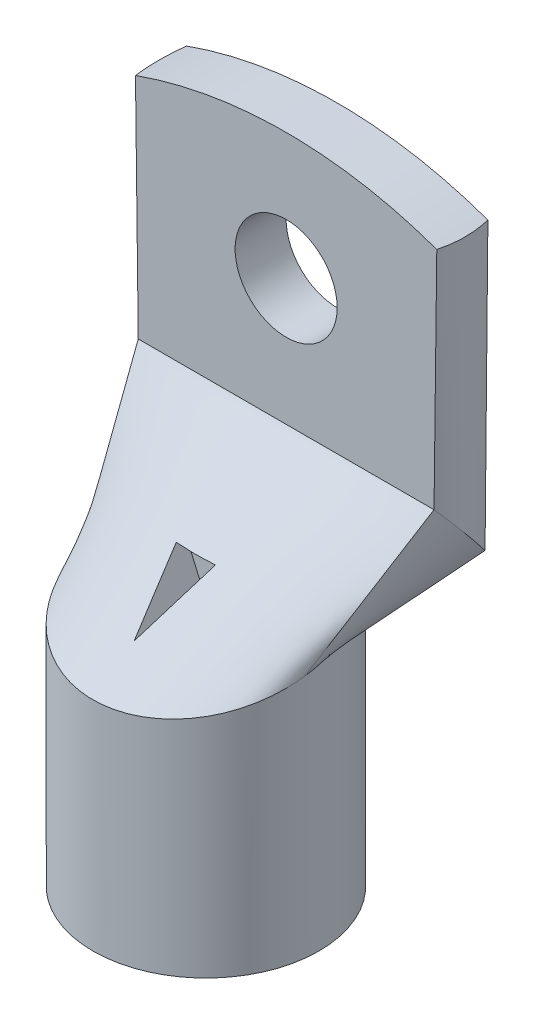
ISO-10303-21;
HEADER;
FILE_DESCRIPTION(('STEP AP214'),'2;1');
FILE_NAME('part.step','',(''),(''),'','','');
FILE_SCHEMA(('AUTOMOTIVE_DESIGN { 1 0 10303 214 1 1 1 1 }'));
ENDSEC;
DATA;
#1=APPLICATION_CONTEXT('core data for automotive mechanical design processes');
#2=APPLICATION_PROTOCOL_DEFINITION('international standard','automotive_design',2000,#1);
#3=PRODUCT_CONTEXT('',#1,'mechanical');
#4=PRODUCT('Part','Part','',(#3));
#5=PRODUCT_RELATED_PRODUCT_CATEGORY('part','',(#4));
#6=PRODUCT_DEFINITION_FORMATION('','',#4);
#7=PRODUCT_DEFINITION_CONTEXT('part definition',#1,'design');
#8=PRODUCT_DEFINITION('design','',#6,#7);
#9=PRODUCT_DEFINITION_SHAPE('','',#8);
#10=(LENGTH_UNIT() NAMED_UNIT(*) SI_UNIT(.MILLI.,.METRE.));
#11=(NAMED_UNIT(*) PLANE_ANGLE_UNIT() SI_UNIT($,.RADIAN.));
#12=(NAMED_UNIT(*) SI_UNIT($,.STERADIAN.) SOLID_ANGLE_UNIT());
#13=UNCERTAINTY_MEASURE_WITH_UNIT(LENGTH_MEASURE(1.E-05),#10,'distance_accuracy_value','');
#14=(GEOMETRIC_REPRESENTATION_CONTEXT(3) GLOBAL_UNCERTAINTY_ASSIGNED_CONTEXT((#13)) GLOBAL_UNIT_ASSIGNED_CONTEXT((#10,
#11,#12)) REPRESENTATION_CONTEXT('',''));
#15=CARTESIAN_POINT('',(0.,0.,0.));
#16=DIRECTION('',(0.,0.,1.));
#17=DIRECTION('',(1.,0.,0.));
#18=AXIS2_PLACEMENT_3D('',#15,#16,#17);
#19=CARTESIAN_POINT('',(-7.69708209556776,16.7577426297167,0.90411681440524));
#20=CARTESIAN_POINT('',(-10.140902466473,24.6565201889272,-5.50000000000008));
#21=CARTESIAN_POINT('',(-6.2409424750663,13.4360683486743,13.3007739974504));
#22=CARTESIAN_POINT('',(-3.38030082215754,24.6565201889272,-5.50000000000002));
#23=CARTESIAN_POINT('',(6.24094247506601,13.4360683486743,13.3007739974505));
#24=CARTESIAN_POINT('',(3.38030082215793,24.6565201889272,-5.49999999999996));
#25=CARTESIAN_POINT('',(7.69708209556774,16.7577426297167,0.904116814405403));
#26=CARTESIAN_POINT('',(10.1409024664734,24.6565201889271,-5.4999999999999));
#27=(BOUNDED_SURFACE() B_SPLINE_SURFACE(3,1,((#19,#20),(#21,#22),(#23,#24),(#25,#26)),
.UNSPECIFIED.,.F.,.F.,.F.) B_SPLINE_SURFACE_WITH_KNOTS((4,4),(2,2),(0.,1.),(0.,1.),
.UNSPECIFIED.) GEOMETRIC_REPRESENTATION_ITEM() RATIONAL_B_SPLINE_SURFACE(((1.,1.),
(0.411106822744544,1.),(0.411106822744544,1.),(1.,1.))) REPRESENTATION_ITEM('') SURFACE());
#28=CARTESIAN_POINT('',(0.,17.,0.));
#29=DIRECTION('',(0.,0.965925826289068,0.258819045102521));
#30=DIRECTION('',(0.,-0.258819045102521,0.965925826289068));
#31=AXIS2_PLACEMENT_3D('',#28,#29,#30);
#32=ELLIPSE('',#31,8.02339039817815,7.75);
#33=CARTESIAN_POINT('',(-7.69708209556776,16.7577426297167,0.904116814405239));
#34=VERTEX_POINT('',#33);
#35=CARTESIAN_POINT('',(7.69708209556774,16.7577426297167,0.904116814405399));
#36=VERTEX_POINT('',#35);
#37=EDGE_CURVE('E377',#34,#36,#32,.T.);
#38=DIRECTION('',(0.233673219935645,0.755265324649086,-0.612348851283007));
#39=VECTOR('',#38,1.);
#40=CARTESIAN_POINT('',(8.91899228102057,20.7071314093219,-2.29794159279725));
#41=LINE('',#40,#39);
#42=CARTESIAN_POINT('',(10.1409024664734,24.6565201889271,-5.4999999999999));
#43=VERTEX_POINT('',#42);
#44=EDGE_CURVE('E393',#36,#43,#41,.T.);
#45=DIRECTION('',(1.,0.,0.));
#46=VECTOR('',#45,1.);
#47=CARTESIAN_POINT('',(10.1409024664734,24.6565201889271,-5.4999999999999));
#48=LINE('',#47,#46);
#49=CARTESIAN_POINT('',(-10.140902466473,24.6565201889272,-5.50000000000008));
#50=VERTEX_POINT('',#49);
#51=EDGE_CURVE('E401',#50,#43,#48,.T.);
#52=DIRECTION('',(0.233673219935606,-0.755265324649097,0.612348851283008));
#53=VECTOR('',#52,1.);
#54=CARTESIAN_POINT('',(-8.91899228102038,20.707131409322,-2.29794159279742));
#55=LINE('',#54,#53);
#56=EDGE_CURVE('E369',#50,#34,#55,.T.);
#57=CARTESIAN_POINT('',(0.,17.,4.92305298611925));
#58=CARTESIAN_POINT('',(-0.0751985066648847,17.1719744440827,4.68894175336969));
#59=CARTESIAN_POINT('',(-0.150275794704584,17.3436716684891,4.45458828098868));
#60=CARTESIAN_POINT('',(-0.300220382164358,17.6865858860084,3.98546516180018));
#61=CARTESIAN_POINT('',(-0.375087682691752,17.8578028816536,3.75069551719797));
#62=CARTESIAN_POINT('',(-0.524645455877794,18.1998324782856,3.28080614016192));
#63=CARTESIAN_POINT('',(-0.5993359287297,18.3706450797143,3.04568640811115));
#64=CARTESIAN_POINT('',(-0.748577989025629,18.7119526600301,2.57517317960015));
#65=CARTESIAN_POINT('',(-0.823129576695926,18.8824476394347,2.33977968358695));
#66=CARTESIAN_POINT('',(-0.972136503512343,19.2232174836807,1.86880201562798));
#67=CARTESIAN_POINT('',(-1.04659184239497,19.3934923479196,1.63321784316306));
#68=CARTESIAN_POINT('',(-1.19545680541074,19.7339375295256,1.16195826595706));
#69=CARTESIAN_POINT('',(-1.2698664293937,19.9041078465493,0.926282860920371));
#70=CARTESIAN_POINT('',(-1.34427832178265,20.0742833512806,0.690612010626282));
#71=B_SPLINE_CURVE_WITH_KNOTS('',3,(#57,#58,#59,#60,#61,#62,#63,#64,#65,#66,#67,#68,#69,#70),
.UNSPECIFIED.,.F.,.F.,(4,2,2,2,2,2,4),(0.,0.900189821345339,1.80037488679664,2.70055896796332,
3.60074158124932,4.50092665373602,5.40111466790692),.UNSPECIFIED.);
#72=CARTESIAN_POINT('',(0.,17.,4.92305298611925));
#73=VERTEX_POINT('',#72);
#74=CARTESIAN_POINT('',(-1.34427832178265,20.0742833512806,0.69061201062626));
#75=VERTEX_POINT('',#74);
#76=EDGE_CURVE('E51',#73,#75,#71,.T.);
#77=CARTESIAN_POINT('',(-1.34427832178265,20.0742833512806,0.690612010626253));
#78=CARTESIAN_POINT('',(-1.23232010981124,20.0742833512806,0.698526686812677));
#79=CARTESIAN_POINT('',(-1.12029152604522,20.0742833512806,0.705442561506306));
#80=CARTESIAN_POINT('',(-0.896233587420302,20.0742833512806,0.717280956945361));
#81=CARTESIAN_POINT('',(-0.784204330275656,20.0742833512806,0.722205326509219));
#82=CARTESIAN_POINT('',(-0.560145759605504,20.0742833512806,0.73007721963578));
#83=CARTESIAN_POINT('',(-0.448116488867758,20.0742833512806,0.733025962528388));
#84=CARTESIAN_POINT('',(-0.22405813830731,20.0742833512806,0.73695599093034));
#85=CARTESIAN_POINT('',(-0.112029069153656,20.0742833512806,0.737937884994995));
#86=CARTESIAN_POINT('',(0.112029069153653,20.0742833512806,0.737937884994999));
#87=CARTESIAN_POINT('',(0.224058138307308,20.0742833512806,0.736955990930349));
#88=CARTESIAN_POINT('',(0.448116488867755,20.0742833512806,0.7330259625284));
#89=CARTESIAN_POINT('',(0.560145759605501,20.0742833512806,0.730077219635791));
#90=CARTESIAN_POINT('',(0.784204330275653,20.0742833512806,0.722205326509231));
#91=CARTESIAN_POINT('',(0.8962335874203,20.0742833512806,0.717280956945376));
#92=CARTESIAN_POINT('',(1.12029152604521,20.0742833512806,0.705442561506326));
#93=CARTESIAN_POINT('',(1.23232010981124,20.0742833512806,0.6985266868127));
#94=CARTESIAN_POINT('',(1.34427832178265,20.0742833512806,0.69061201062628));
#95=B_SPLINE_CURVE_WITH_KNOTS('',3,(#77,#78,#79,#80,#81,#82,#83,#84,#85,#86,#87,#88,#89,#90,#91,
#92,#93,#94),.UNSPECIFIED.,.F.,.F.,(4,2,2,2,2,2,2,2,4),(0.,0.336708044001101,0.673102782772896,
1.00928971156104,1.34537260593714,1.68145550031325,2.01764242910139,2.35403716787318,
2.69074521187428),.UNSPECIFIED.);
#96=CARTESIAN_POINT('',(1.34427832178265,20.0742833512806,0.690612010626283));
#97=VERTEX_POINT('',#96);
#98=EDGE_CURVE('E11',#75,#97,#95,.T.);
#99=CARTESIAN_POINT('',(1.34427832178265,20.0742833512806,0.690612010626276));
#100=CARTESIAN_POINT('',(1.2698664293937,19.9041078465494,0.926282860920369));
#101=CARTESIAN_POINT('',(1.19545680541075,19.7339375295257,1.16195826595706));
#102=CARTESIAN_POINT('',(1.04659184239498,19.3934923479196,1.63321784316306));
#103=CARTESIAN_POINT('',(0.972136503512349,19.2232174836807,1.86880201562798));
#104=CARTESIAN_POINT('',(0.823129576695929,18.8824476394347,2.33977968358696));
#105=CARTESIAN_POINT('',(0.748577989025632,18.7119526600301,2.57517317960016));
#106=CARTESIAN_POINT('',(0.599335928729702,18.3706450797143,3.04568640811116));
#107=CARTESIAN_POINT('',(0.524645455877795,18.1998324782856,3.28080614016193));
#108=CARTESIAN_POINT('',(0.37508768269175,17.8578028816536,3.75069551719798));
#109=CARTESIAN_POINT('',(0.300220382164353,17.6865858860084,3.98546516180019));
#110=CARTESIAN_POINT('',(0.150275794704576,17.3436716684891,4.45458828098869));
#111=CARTESIAN_POINT('',(0.075198506664877,17.1719744440827,4.6889417533697));
#112=CARTESIAN_POINT('',(0.,17.,4.92305298611927));
#113=B_SPLINE_CURVE_WITH_KNOTS('',3,(#99,#100,#101,#102,#103,#104,#105,#106,#107,#108,#109,#110,
#111,#112),.UNSPECIFIED.,.F.,.F.,(4,2,2,2,2,2,4),(0.,0.900188014170906,1.80037308665761,
2.70055569994362,3.60073978111031,4.50092484656161,5.40111466790696),.UNSPECIFIED.);
#114=EDGE_CURVE('E211',#97,#73,#113,.T.);
#115=ORIENTED_EDGE('',*,*,#37,.T.);
#116=ORIENTED_EDGE('',*,*,#44,.T.);
#117=ORIENTED_EDGE('',*,*,#51,.F.);
#118=ORIENTED_EDGE('',*,*,#56,.T.);
#119=EDGE_LOOP('',(#115,#116,#117,#118));
#120=FACE_BOUND('',#119,.T.);
#121=ORIENTED_EDGE('',*,*,#76,.T.);
#122=ORIENTED_EDGE('',*,*,#98,.T.);
#123=ORIENTED_EDGE('',*,*,#114,.T.);
#124=EDGE_LOOP('',(#121,#122,#123));
#125=FACE_BOUND('',#124,.T.);
#126=ADVANCED_FACE('F38',(#120,#125),#27,.T.);
#127=CARTESIAN_POINT('',(0.,39.3069426257091,0.));
#128=DIRECTION('',(0.,-1.,0.));
#129=DIRECTION('',(0.,0.,-1.));
#130=AXIS2_PLACEMENT_3D('',#127,#128,#129);
#131=CYLINDRICAL_SURFACE('',#130,7.75);
#132=CARTESIAN_POINT('',(0.,0.,0.));
#133=DIRECTION('',(0.,1.,0.));
#134=DIRECTION('',(0.,0.,1.));
#135=AXIS2_PLACEMENT_3D('',#132,#133,#134);
#136=CIRCLE('',#135,7.75);
#137=CARTESIAN_POINT('',(0.,0.,7.75));
#138=VERTEX_POINT('',#137);
#139=EDGE_CURVE('E354',#138,#138,#136,.T.);
#140=ORIENTED_EDGE('',*,*,#139,.T.);
#141=EDGE_LOOP('',(#140));
#142=FACE_BOUND('',#141,.T.);
#143=CARTESIAN_POINT('',(0.,17.,0.));
#144=DIRECTION('',(0.,0.965925826289068,0.258819045102521));
#145=DIRECTION('',(0.,-0.258819045102521,0.965925826289068));
#146=AXIS2_PLACEMENT_3D('',#143,#144,#145);
#147=ELLIPSE('',#146,8.02339039817815,7.75);
#148=CARTESIAN_POINT('',(7.69708209556776,17.2422573702833,-0.904116814405239));
#149=VERTEX_POINT('',#148);
#150=EDGE_CURVE('E355',#36,#149,#147,.T.);
#151=ORIENTED_EDGE('',*,*,#150,.F.);
#152=ORIENTED_EDGE('',*,*,#37,.F.);
#153=CARTESIAN_POINT('',(-7.69708209556774,17.2422573702833,-0.904116814405396));
#154=VERTEX_POINT('',#153);
#155=EDGE_CURVE('E378',#154,#34,#32,.T.);
#156=ORIENTED_EDGE('',*,*,#155,.F.);
#157=EDGE_CURVE('E373',#149,#154,#32,.T.);
#158=ORIENTED_EDGE('',*,*,#157,.F.);
#159=EDGE_LOOP('',(#151,#152,#156,#158));
#160=FACE_BOUND('',#159,.T.);
#161=ADVANCED_FACE('F40',(#142,#160),#131,.T.);
#162=CARTESIAN_POINT('',(0.,0.,0.));
#163=DIRECTION('',(0.,1.,0.));
#164=DIRECTION('',(0.,0.,1.));
#165=AXIS2_PLACEMENT_3D('',#162,#163,#164);
#166=PLANE('',#165);
#167=CARTESIAN_POINT('',(0.,0.,0.));
#168=DIRECTION('',(0.,-1.,0.));
#169=DIRECTION('',(0.,0.,-1.));
#170=AXIS2_PLACEMENT_3D('',#167,#168,#169);
#171=CIRCLE('',#170,6.5);
#172=CARTESIAN_POINT('',(0.,0.,-6.5));
#173=VERTEX_POINT('',#172);
#174=EDGE_CURVE('E351',#173,#173,#171,.T.);
#175=ORIENTED_EDGE('',*,*,#174,.F.);
#176=EDGE_LOOP('',(#175));
#177=FACE_BOUND('',#176,.T.);
#178=ORIENTED_EDGE('',*,*,#139,.F.);
#179=EDGE_LOOP('',(#178));
#180=FACE_BOUND('',#179,.T.);
#181=ADVANCED_FACE('F191',(#177,#180),#166,.F.);
#182=CARTESIAN_POINT('',(0.,0.,0.));
#183=DIRECTION('',(0.,-1.,0.));
#184=DIRECTION('',(0.,0.,-1.));
#185=AXIS2_PLACEMENT_3D('',#182,#183,#184);
#186=CYLINDRICAL_SURFACE('',#185,6.5);
#187=CARTESIAN_POINT('',(0.,15.0573683548744,0.));
#188=DIRECTION('',(0.,-1.,0.));
#189=DIRECTION('',(0.,0.,-1.));
#190=AXIS2_PLACEMENT_3D('',#187,#188,#189);
#191=CIRCLE('',#190,6.5);
#192=CARTESIAN_POINT('',(0.,15.0573683548744,-6.5));
#193=VERTEX_POINT('',#192);
#194=EDGE_CURVE('E360',#193,#193,#191,.T.);
#195=ORIENTED_EDGE('',*,*,#194,.F.);
#196=EDGE_LOOP('',(#195));
#197=FACE_BOUND('',#196,.T.);
#198=ORIENTED_EDGE('',*,*,#174,.T.);
#199=EDGE_LOOP('',(#198));
#200=FACE_BOUND('',#199,.T.);
#201=ADVANCED_FACE('F300',(#197,#200),#186,.F.);
#202=CARTESIAN_POINT('',(6.5,15.0573683548744,0.));
#203=DIRECTION('',(0.,1.,0.));
#204=DIRECTION('',(0.,0.,1.));
#205=AXIS2_PLACEMENT_3D('',#202,#203,#204);
#206=PLANE('',#205);
#207=ORIENTED_EDGE('',*,*,#194,.T.);
#208=EDGE_LOOP('',(#207));
#209=FACE_BOUND('',#208,.T.);
#210=ADVANCED_FACE('F292',(#209),#206,.F.);
#211=CARTESIAN_POINT('',(7.69708209556774,16.7577426297167,0.9041168144054));
#212=CARTESIAN_POINT('',(10.1409024664734,24.6565201889271,-5.4999999999999));
#213=CARTESIAN_POINT('',(7.76771996413277,16.9188782708163,0.302750414911368));
#214=CARTESIAN_POINT('',(10.6224919757059,23.2823610255796,-6.65305644714369));
#215=CARTESIAN_POINT('',(7.76771996413278,17.0811217291837,-0.302750414911206));
#216=CARTESIAN_POINT('',(10.6224919757059,21.8595417781949,-7.84694355285611));
#217=CARTESIAN_POINT('',(7.69708209556776,17.2422573702833,-0.904116814405239));
#218=CARTESIAN_POINT('',(10.1409024664734,20.4853826148474,-8.9999999999999));
#219=(BOUNDED_SURFACE() B_SPLINE_SURFACE(3,1,((#211,#212),(#213,#214),(#215,#216),(#217,#218)),
.UNSPECIFIED.,.F.,.F.,.F.) B_SPLINE_SURFACE_WITH_KNOTS((4,4),(2,2),(0.,1.),(0.,1.),
.UNSPECIFIED.) GEOMETRIC_REPRESENTATION_ITEM() RATIONAL_B_SPLINE_SURFACE(((1.,1.),
(0.995447922199376,0.977200156601482),(0.995447922199376,0.977200156601482),(1.,1.))) REPRESENTATION_ITEM('') SURFACE());
#220=DIRECTION('',(0.269819795270615,0.358070257512816,-0.893858472446746));
#221=VECTOR('',#220,1.);
#222=CARTESIAN_POINT('',(8.91899228102058,18.8638199925654,-4.95205840720257));
#223=LINE('',#222,#221);
#224=CARTESIAN_POINT('',(10.1409024664734,20.4853826148474,-8.9999999999999));
#225=VERTEX_POINT('',#224);
#226=EDGE_CURVE('E366',#149,#225,#223,.T.);
#227=CARTESIAN_POINT('',(0.,22.5709514018873,-7.24999999999999));
#228=DIRECTION('',(0.,0.642787609686544,-0.766044443118974));
#229=DIRECTION('',(0.,0.766044443118974,0.642787609686544));
#230=AXIS2_PLACEMENT_3D('',#227,#228,#229);
#231=CIRCLE('',#230,10.5000000000001);
#232=EDGE_CURVE('E385',#43,#225,#231,.T.);
#233=ORIENTED_EDGE('',*,*,#150,.T.);
#234=ORIENTED_EDGE('',*,*,#226,.T.);
#235=ORIENTED_EDGE('',*,*,#232,.F.);
#236=ORIENTED_EDGE('',*,*,#44,.F.);
#237=EDGE_LOOP('',(#233,#234,#235,#236));
#238=FACE_BOUND('',#237,.T.);
#239=ADVANCED_FACE('F199',(#238),#219,.T.);
#240=CARTESIAN_POINT('',(-7.69708209556774,17.2422573702833,-0.904116814405396));
#241=CARTESIAN_POINT('',(-10.140902466473,20.4853826148475,-9.00000000000008));
#242=CARTESIAN_POINT('',(-7.76771996413277,17.0811217291837,-0.302750414911365));
#243=CARTESIAN_POINT('',(-10.6224919757056,21.859541778195,-7.84694355285629));
#244=CARTESIAN_POINT('',(-7.76771996413278,16.9188782708163,0.302750414911208));
#245=CARTESIAN_POINT('',(-10.6224919757056,23.2823610255797,-6.65305644714387));
#246=CARTESIAN_POINT('',(-7.69708209556776,16.7577426297167,0.90411681440524));
#247=CARTESIAN_POINT('',(-10.140902466473,24.6565201889272,-5.50000000000007));
#248=(BOUNDED_SURFACE() B_SPLINE_SURFACE(3,1,((#240,#241),(#242,#243),(#244,#245),(#246,#247)),
.UNSPECIFIED.,.F.,.F.,.F.) B_SPLINE_SURFACE_WITH_KNOTS((4,4),(2,2),(0.,1.),(0.,1.),
.UNSPECIFIED.) GEOMETRIC_REPRESENTATION_ITEM() RATIONAL_B_SPLINE_SURFACE(((1.,1.),
(0.995447922199376,0.977200156601481),(0.995447922199376,0.977200156601481),(1.,1.))) REPRESENTATION_ITEM('') SURFACE());
#249=CARTESIAN_POINT('',(0.,22.5709514018873,-7.24999999999999));
#250=DIRECTION('',(0.,0.642787609686544,-0.766044443118974));
#251=DIRECTION('',(0.,-0.766044443118974,-0.642787609686544));
#252=AXIS2_PLACEMENT_3D('',#249,#250,#251);
#253=CIRCLE('',#252,10.4999999999997);
#254=CARTESIAN_POINT('',(-10.140902466473,20.4853826148475,-9.00000000000008));
#255=VERTEX_POINT('',#254);
#256=EDGE_CURVE('E417',#255,#50,#253,.T.);
#257=DIRECTION('',(0.269819795270574,-0.358070257512831,0.893858472446752));
#258=VECTOR('',#257,1.);
#259=CARTESIAN_POINT('',(-8.91899228102037,18.8638199925654,-4.95205840720274));
#260=LINE('',#259,#258);
#261=EDGE_CURVE('E370',#255,#154,#260,.T.);
#262=ORIENTED_EDGE('',*,*,#155,.T.);
#263=ORIENTED_EDGE('',*,*,#56,.F.);
#264=ORIENTED_EDGE('',*,*,#256,.F.);
#265=ORIENTED_EDGE('',*,*,#261,.T.);
#266=EDGE_LOOP('',(#262,#263,#264,#265));
#267=FACE_BOUND('',#266,.T.);
#268=ADVANCED_FACE('F279',(#267),#248,.T.);
#269=CARTESIAN_POINT('',(7.69708209556776,17.2422573702833,-0.904116814405239));
#270=CARTESIAN_POINT('',(10.1409024664734,20.4853826148474,-8.9999999999999));
#271=CARTESIAN_POINT('',(6.24094247506629,20.5639316513257,-13.3007739974504));
#272=CARTESIAN_POINT('',(3.38030082215793,20.4853826148475,-8.99999999999996));
#273=CARTESIAN_POINT('',(-6.24094247506602,20.5639316513257,-13.3007739974505));
#274=CARTESIAN_POINT('',(-3.38030082215754,20.4853826148475,-9.00000000000002));
#275=CARTESIAN_POINT('',(-7.69708209556774,17.2422573702833,-0.904116814405396));
#276=CARTESIAN_POINT('',(-10.140902466473,20.4853826148475,-9.00000000000008));
#277=(BOUNDED_SURFACE() B_SPLINE_SURFACE(3,1,((#269,#270),(#271,#272),(#273,#274),(#275,#276)),
.UNSPECIFIED.,.F.,.F.,.F.) B_SPLINE_SURFACE_WITH_KNOTS((4,4),(2,2),(0.,1.),(0.,1.),
.UNSPECIFIED.) GEOMETRIC_REPRESENTATION_ITEM() RATIONAL_B_SPLINE_SURFACE(((1.,1.),
(0.411106822744543,1.),(0.411106822744543,1.),(1.,1.))) REPRESENTATION_ITEM('') SURFACE());
#278=DIRECTION('',(-1.,0.,0.));
#279=VECTOR('',#278,1.);
#280=CARTESIAN_POINT('',(-10.140902466473,20.4853826148475,-9.00000000000008));
#281=LINE('',#280,#279);
#282=EDGE_CURVE('E432',#225,#255,#281,.T.);
#283=ORIENTED_EDGE('',*,*,#157,.T.);
#284=ORIENTED_EDGE('',*,*,#261,.F.);
#285=ORIENTED_EDGE('',*,*,#282,.F.);
#286=ORIENTED_EDGE('',*,*,#226,.F.);
#287=EDGE_LOOP('',(#283,#284,#285,#286));
#288=FACE_BOUND('',#287,.T.);
#289=ADVANCED_FACE('F170',(#288),#277,.T.);
#290=CARTESIAN_POINT('',(-10.3531396204243,42.,-8.99999999999999));
#291=DIRECTION('',(0.,0.,1.));
#292=DIRECTION('',(0.,-1.,0.));
#293=AXIS2_PLACEMENT_3D('',#290,#291,#292);
#294=PLANE('',#293);
#295=CARTESIAN_POINT('',(0.,33.3282600944636,-9.00000000000002));
#296=DIRECTION('',(0.,0.,1.));
#297=DIRECTION('',(0.,-1.,0.));
#298=AXIS2_PLACEMENT_3D('',#295,#296,#297);
#299=CIRCLE('',#298,3.5);
#300=CARTESIAN_POINT('',(3.5,33.3282600944636,-9.00000000000002));
#301=VERTEX_POINT('',#300);
#302=EDGE_CURVE('E406',#301,#301,#299,.T.);
#303=ORIENTED_EDGE('',*,*,#302,.T.);
#304=EDGE_LOOP('',(#303));
#305=FACE_BOUND('',#304,.T.);
#306=DIRECTION('',(-0.00986430871981578,0.99995134652316,0.));
#307=VECTOR('',#306,1.);
#308=CARTESIAN_POINT('',(-10.140902466473,20.4853826148475,-9.00000000000008));
#309=LINE('',#308,#307);
#310=CARTESIAN_POINT('',(-10.3354611659252,40.2079236484805,-9.));
#311=VERTEX_POINT('',#310);
#312=EDGE_CURVE('E419',#255,#311,#309,.T.);
#313=ORIENTED_EDGE('',*,*,#312,.T.);
#314=CARTESIAN_POINT('',(0.,11.3000537982865,-9.00000000000012));
#315=DIRECTION('',(0.,0.,1.));
#316=DIRECTION('',(0.,-1.,0.));
#317=AXIS2_PLACEMENT_3D('',#314,#315,#316);
#318=CIRCLE('',#317,30.6999462017135);
#319=CARTESIAN_POINT('',(10.3354611659252,40.2079236484805,-8.99999999999998));
#320=VERTEX_POINT('',#319);
#321=EDGE_CURVE('E407',#311,#320,#318,.F.);
#322=ORIENTED_EDGE('',*,*,#321,.T.);
#323=DIRECTION('',(0.00986430871979743,0.99995134652316,0.));
#324=VECTOR('',#323,1.);
#325=CARTESIAN_POINT('',(10.1409024664734,20.4853826148474,-8.9999999999999));
#326=LINE('',#325,#324);
#327=EDGE_CURVE('E424',#225,#320,#326,.T.);
#328=ORIENTED_EDGE('',*,*,#327,.F.);
#329=ORIENTED_EDGE('',*,*,#282,.T.);
#330=EDGE_LOOP('',(#313,#322,#328,#329));
#331=FACE_BOUND('',#330,.T.);
#332=ADVANCED_FACE('F167',(#305,#331),#294,.F.);
#333=CARTESIAN_POINT('',(10.1409024664734,24.6565201889271,-5.4999999999999));
#334=CARTESIAN_POINT('',(10.3531396204243,42.,-5.5));
#335=CARTESIAN_POINT('',(10.6224919757059,23.2823610255796,-6.65305644714368));
#336=CARTESIAN_POINT('',(10.5494142212099,42.,-6.66117619764334));
#337=CARTESIAN_POINT('',(10.6224919757059,21.8595417781949,-7.8469435528561));
#338=CARTESIAN_POINT('',(10.5494142212099,42.,-7.83882380235664));
#339=CARTESIAN_POINT('',(10.1409024664734,20.4853826148474,-8.9999999999999));
#340=CARTESIAN_POINT('',(10.3531396204243,42.,-8.99999999999999));
#341=(BOUNDED_SURFACE() B_SPLINE_SURFACE(3,1,((#333,#334),(#335,#336),(#337,#338),(#339,#340)),
.UNSPECIFIED.,.F.,.F.,.F.) B_SPLINE_SURFACE_WITH_KNOTS((4,4),(2,2),(0.,1.),(0.,1.),
.UNSPECIFIED.) GEOMETRIC_REPRESENTATION_ITEM() RATIONAL_B_SPLINE_SURFACE(((1.,1.),
(0.977200156601482,0.990675531455513),(0.977200156601482,0.990675531455513),(1.,1.))) REPRESENTATION_ITEM('') SURFACE());
#342=CARTESIAN_POINT('',(10.331227983134,40.2094367932349,-5.49999999999999));
#343=CARTESIAN_POINT('',(10.3649848815776,40.1973671051231,-5.67312777364426));
#344=CARTESIAN_POINT('',(10.3937363558727,40.187031495676,-5.84735485740968));
#345=CARTESIAN_POINT('',(10.4411064505357,40.1699467946234,-6.19730543640789));
#346=CARTESIAN_POINT('',(10.4597278895332,40.1631967053778,-6.37302850155624));
#347=CARTESIAN_POINT('',(10.4867357645457,40.1533942173439,-6.72537813901417));
#348=CARTESIAN_POINT('',(10.4951214926286,40.1503420743166,-6.90200477296897));
#349=CARTESIAN_POINT('',(10.5016960998267,40.147949533035,-7.25548952089617));
#350=CARTESIAN_POINT('',(10.4998831836884,40.148609788269,-7.43234767014364));
#351=CARTESIAN_POINT('',(10.4839802253007,40.1543944615366,-7.84252015517167));
#352=CARTESIAN_POINT('',(10.4661266310365,40.1608872596095,-8.07568487088299));
#353=CARTESIAN_POINT('',(10.4265762175858,40.1751881835713,-8.42374827985465));
#354=CARTESIAN_POINT('',(10.4112595944004,40.1807171788343,-8.5395142972612));
#355=CARTESIAN_POINT('',(10.3764611955702,40.193237887971,-8.77032600688958));
#356=CARTESIAN_POINT('',(10.3569798971692,40.2002294342441,-8.88537178009307));
#357=CARTESIAN_POINT('',(10.3354611659252,40.2079236484805,-8.99999999999998));
#358=B_SPLINE_CURVE_WITH_KNOTS('',3,(#342,#343,#344,#345,#346,#347,#348,#349,#350,#351,#352,
#353,#354,#355,#356,#357),.UNSPECIFIED.,.F.,.F.,(4,2,2,2,2,2,2,4),(0.,0.530322481405891,
1.06049732777264,1.59070884053033,2.12101368862063,2.82199497007149,3.1726412031774,
3.52324727610174),.UNSPECIFIED.);
#359=CARTESIAN_POINT('',(10.331227983134,40.2094367932349,-5.49999999999999));
#360=VERTEX_POINT('',#359);
#361=EDGE_CURVE('E144',#360,#320,#358,.T.);
#362=DIRECTION('',(-0.0122363716313973,-0.9999251328021,0.));
#363=VECTOR('',#362,1.);
#364=CARTESIAN_POINT('',(10.2470210434489,33.3282600944636,-5.49999999999995));
#365=LINE('',#364,#363);
#366=EDGE_CURVE('E414',#360,#43,#365,.T.);
#367=ORIENTED_EDGE('',*,*,#361,.F.);
#368=ORIENTED_EDGE('',*,*,#366,.T.);
#369=ORIENTED_EDGE('',*,*,#232,.T.);
#370=ORIENTED_EDGE('',*,*,#327,.T.);
#371=EDGE_LOOP('',(#367,#368,#369,#370));
#372=FACE_BOUND('',#371,.T.);
#373=ADVANCED_FACE('F169',(#372),#341,.T.);
#374=CARTESIAN_POINT('',(-10.140902466473,20.4853826148475,-9.00000000000008));
#375=CARTESIAN_POINT('',(-10.3531396204243,42.,-8.99999999999999));
#376=CARTESIAN_POINT('',(-10.6224919757056,21.8595417781951,-7.84694355285629));
#377=CARTESIAN_POINT('',(-10.5494142212099,42.,-7.83882380235665));
#378=CARTESIAN_POINT('',(-10.6224919757056,23.2823610255797,-6.65305644714387));
#379=CARTESIAN_POINT('',(-10.5494142212099,42.,-6.66117619764334));
#380=CARTESIAN_POINT('',(-10.140902466473,24.6565201889272,-5.50000000000007));
#381=CARTESIAN_POINT('',(-10.3531396204243,42.,-5.5));
#382=(BOUNDED_SURFACE() B_SPLINE_SURFACE(3,1,((#374,#375),(#376,#377),(#378,#379),(#380,#381)),
.UNSPECIFIED.,.F.,.F.,.F.) B_SPLINE_SURFACE_WITH_KNOTS((4,4),(2,2),(0.,1.),(0.,1.),
.UNSPECIFIED.) GEOMETRIC_REPRESENTATION_ITEM() RATIONAL_B_SPLINE_SURFACE(((1.,1.),
(0.977200156601481,0.990675531455513),(0.977200156601481,0.990675531455513),(1.,1.))) REPRESENTATION_ITEM('') SURFACE());
#383=CARTESIAN_POINT('',(-10.3354611659252,40.2079236484805,-9.));
#384=CARTESIAN_POINT('',(-10.3680060116457,40.1962826867712,-8.82669657967682));
#385=CARTESIAN_POINT('',(-10.395881312084,40.186259304634,-8.65239292824559));
#386=CARTESIAN_POINT('',(-10.4420044756122,40.1696211901035,-8.3023431980071));
#387=CARTESIAN_POINT('',(-10.460251565527,40.1630067314583,-8.12659700450978));
#388=CARTESIAN_POINT('',(-10.4868268355653,40.1533610835738,-7.77421915022164));
#389=CARTESIAN_POINT('',(-10.4951533774969,40.1503304861423,-7.59758734802378));
#390=CARTESIAN_POINT('',(-10.5016870238352,40.147952820876,-7.24412598578596));
#391=CARTESIAN_POINT('',(-10.4998943203646,40.1486056831074,-7.06729642956425));
#392=CARTESIAN_POINT('',(-10.483847700289,40.1544427328302,-6.65716408750507));
#393=CARTESIAN_POINT('',(-10.4657671287037,40.1610183226021,-6.42401141399331));
#394=CARTESIAN_POINT('',(-10.4252850318624,40.175654526402,-6.07601975749051));
#395=CARTESIAN_POINT('',(-10.4095532549721,40.1813326426245,-5.96025639984909));
#396=CARTESIAN_POINT('',(-10.3736829768987,40.1942358252255,-5.72950789500078));
#397=CARTESIAN_POINT('',(-10.35354473315,40.2014608012328,-5.61452270273634));
#398=CARTESIAN_POINT('',(-10.3312279831339,40.2094367932349,-5.50000000000001));
#399=B_SPLINE_CURVE_WITH_KNOTS('',3,(#383,#384,#385,#386,#387,#388,#389,#390,#391,#392,#393,
#394,#395,#396,#397,#398),.UNSPECIFIED.,.F.,.F.,(4,2,2,2,2,2,2,4),(0.,0.530098883166026,
1.06024032842858,1.5904693044504,2.1206882136514,2.82163850343389,3.17245394989444,
3.5232489064997),.UNSPECIFIED.);
#400=CARTESIAN_POINT('',(-10.3312279831339,40.2094367932349,-5.49999999999987));
#401=VERTEX_POINT('',#400);
#402=EDGE_CURVE('E66',#311,#401,#399,.T.);
#403=DIRECTION('',(-0.0122363716314196,0.9999251328021,0.));
#404=VECTOR('',#403,1.);
#405=CARTESIAN_POINT('',(-10.2470210434487,33.3282600944636,-5.50000000000004));
#406=LINE('',#405,#404);
#407=EDGE_CURVE('E383',#50,#401,#406,.T.);
#408=ORIENTED_EDGE('',*,*,#402,.F.);
#409=ORIENTED_EDGE('',*,*,#312,.F.);
#410=ORIENTED_EDGE('',*,*,#256,.T.);
#411=ORIENTED_EDGE('',*,*,#407,.T.);
#412=EDGE_LOOP('',(#408,#409,#410,#411));
#413=FACE_BOUND('',#412,.T.);
#414=ADVANCED_FACE('F150',(#413),#382,.T.);
#415=CARTESIAN_POINT('',(10.1409024664734,24.6565201889271,-5.4999999999999));
#416=DIRECTION('',(0.,0.,-1.));
#417=DIRECTION('',(-1.,0.,0.));
#418=AXIS2_PLACEMENT_3D('',#415,#416,#417);
#419=PLANE('',#418);
#420=CARTESIAN_POINT('',(0.,33.3282600944636,-5.50000000000004));
#421=DIRECTION('',(0.,0.,-1.));
#422=DIRECTION('',(-1.,0.,0.));
#423=AXIS2_PLACEMENT_3D('',#420,#421,#422);
#424=CIRCLE('',#423,3.5);
#425=CARTESIAN_POINT('',(3.5,33.3282600944636,-5.50000000000001));
#426=VERTEX_POINT('',#425);
#427=EDGE_CURVE('E404',#426,#426,#424,.T.);
#428=ORIENTED_EDGE('',*,*,#427,.T.);
#429=EDGE_LOOP('',(#428));
#430=FACE_BOUND('',#429,.T.);
#431=ORIENTED_EDGE('',*,*,#366,.F.);
#432=CARTESIAN_POINT('',(0.,11.3000537982865,-5.49999999999991));
#433=DIRECTION('',(0.,0.,-1.));
#434=DIRECTION('',(-1.,0.,0.));
#435=AXIS2_PLACEMENT_3D('',#432,#433,#434);
#436=CIRCLE('',#435,30.6999462017135);
#437=EDGE_CURVE('E358',#360,#401,#436,.F.);
#438=ORIENTED_EDGE('',*,*,#437,.T.);
#439=ORIENTED_EDGE('',*,*,#407,.F.);
#440=ORIENTED_EDGE('',*,*,#51,.T.);
#441=EDGE_LOOP('',(#431,#438,#439,#440));
#442=FACE_BOUND('',#441,.T.);
#443=ADVANCED_FACE('F165',(#430,#442),#419,.F.);
#444=CARTESIAN_POINT('',(0.,33.3282600944636,-13.3107739974505));
#445=DIRECTION('',(0.,0.,1.));
#446=DIRECTION('',(1.,0.,0.));
#447=AXIS2_PLACEMENT_3D('',#444,#445,#446);
#448=CYLINDRICAL_SURFACE('',#447,3.5);
#449=CARTESIAN_POINT('',(3.5,33.3282600944636,-5.50000000000001));
#450=CARTESIAN_POINT('',(3.5,33.3282600944636,-5.53645833333334));
#451=CARTESIAN_POINT('',(3.5,33.3282600944636,-5.57291666666668));
#452=CARTESIAN_POINT('',(3.5,33.3282600944636,-5.64583333333334));
#453=CARTESIAN_POINT('',(3.5,33.3282600944636,-5.68229166666668));
#454=CARTESIAN_POINT('',(3.5,33.3282600944636,-5.75520833333334));
#455=CARTESIAN_POINT('',(3.5,33.3282600944636,-5.79166666666668));
#456=CARTESIAN_POINT('',(3.5,33.3282600944636,-5.86458333333334));
#457=CARTESIAN_POINT('',(3.5,33.3282600944636,-5.90104166666668));
#458=CARTESIAN_POINT('',(3.5,33.3282600944636,-5.97395833333334));
#459=CARTESIAN_POINT('',(3.5,33.3282600944636,-6.01041666666668));
#460=CARTESIAN_POINT('',(3.5,33.3282600944636,-6.08333333333335));
#461=CARTESIAN_POINT('',(3.5,33.3282600944636,-6.11979166666668));
#462=CARTESIAN_POINT('',(3.5,33.3282600944636,-6.19270833333335));
#463=CARTESIAN_POINT('',(3.5,33.3282600944636,-6.22916666666668));
#464=CARTESIAN_POINT('',(3.5,33.3282600944636,-6.30208333333335));
#465=CARTESIAN_POINT('',(3.5,33.3282600944636,-6.33854166666668));
#466=CARTESIAN_POINT('',(3.5,33.3282600944636,-6.41145833333335));
#467=CARTESIAN_POINT('',(3.5,33.3282600944636,-6.44791666666668));
#468=CARTESIAN_POINT('',(3.5,33.3282600944636,-6.52083333333335));
#469=CARTESIAN_POINT('',(3.5,33.3282600944636,-6.55729166666668));
#470=CARTESIAN_POINT('',(3.5,33.3282600944636,-6.63020833333335));
#471=CARTESIAN_POINT('',(3.5,33.3282600944636,-6.66666666666668));
#472=CARTESIAN_POINT('',(3.5,33.3282600944636,-6.73958333333335));
#473=CARTESIAN_POINT('',(3.5,33.3282600944636,-6.77604166666668));
#474=CARTESIAN_POINT('',(3.5,33.3282600944636,-6.84895833333335));
#475=CARTESIAN_POINT('',(3.5,33.3282600944636,-6.88541666666668));
#476=CARTESIAN_POINT('',(3.5,33.3282600944636,-6.95833333333335));
#477=CARTESIAN_POINT('',(3.5,33.3282600944636,-6.99479166666668));
#478=CARTESIAN_POINT('',(3.5,33.3282600944636,-7.06770833333335));
#479=CARTESIAN_POINT('',(3.5,33.3282600944636,-7.10416666666668));
#480=CARTESIAN_POINT('',(3.5,33.3282600944636,-7.17708333333335));
#481=CARTESIAN_POINT('',(3.5,33.3282600944636,-7.21354166666668));
#482=CARTESIAN_POINT('',(3.5,33.3282600944636,-7.28645833333335));
#483=CARTESIAN_POINT('',(3.5,33.3282600944636,-7.32291666666668));
#484=CARTESIAN_POINT('',(3.5,33.3282600944636,-7.39583333333335));
#485=CARTESIAN_POINT('',(3.5,33.3282600944636,-7.43229166666668));
#486=CARTESIAN_POINT('',(3.5,33.3282600944636,-7.50520833333335));
#487=CARTESIAN_POINT('',(3.5,33.3282600944636,-7.54166666666669));
#488=CARTESIAN_POINT('',(3.5,33.3282600944636,-7.61458333333335));
#489=CARTESIAN_POINT('',(3.5,33.3282600944636,-7.65104166666669));
#490=CARTESIAN_POINT('',(3.5,33.3282600944636,-7.72395833333335));
#491=CARTESIAN_POINT('',(3.5,33.3282600944636,-7.76041666666669));
#492=CARTESIAN_POINT('',(3.5,33.3282600944636,-7.83333333333335));
#493=CARTESIAN_POINT('',(3.5,33.3282600944636,-7.86979166666669));
#494=CARTESIAN_POINT('',(3.5,33.3282600944636,-7.94270833333336));
#495=CARTESIAN_POINT('',(3.5,33.3282600944636,-7.97916666666669));
#496=CARTESIAN_POINT('',(3.5,33.3282600944636,-8.05208333333336));
#497=CARTESIAN_POINT('',(3.5,33.3282600944636,-8.08854166666669));
#498=CARTESIAN_POINT('',(3.5,33.3282600944636,-8.16145833333336));
#499=CARTESIAN_POINT('',(3.5,33.3282600944636,-8.19791666666669));
#500=CARTESIAN_POINT('',(3.5,33.3282600944636,-8.27083333333336));
#501=CARTESIAN_POINT('',(3.5,33.3282600944636,-8.30729166666669));
#502=CARTESIAN_POINT('',(3.5,33.3282600944636,-8.38020833333336));
#503=CARTESIAN_POINT('',(3.5,33.3282600944636,-8.41666666666669));
#504=CARTESIAN_POINT('',(3.5,33.3282600944636,-8.48958333333336));
#505=CARTESIAN_POINT('',(3.5,33.3282600944636,-8.52604166666669));
#506=CARTESIAN_POINT('',(3.5,33.3282600944636,-8.59895833333336));
#507=CARTESIAN_POINT('',(3.5,33.3282600944636,-8.63541666666669));
#508=CARTESIAN_POINT('',(3.5,33.3282600944636,-8.70833333333336));
#509=CARTESIAN_POINT('',(3.5,33.3282600944636,-8.74479166666669));
#510=CARTESIAN_POINT('',(3.5,33.3282600944636,-8.81770833333336));
#511=CARTESIAN_POINT('',(3.5,33.3282600944636,-8.85416666666669));
#512=CARTESIAN_POINT('',(3.5,33.3282600944636,-8.92708333333336));
#513=CARTESIAN_POINT('',(3.5,33.3282600944636,-8.96354166666669));
#514=CARTESIAN_POINT('',(3.5,33.3282600944636,-9.00000000000002));
#515=B_SPLINE_CURVE_WITH_KNOTS('',3,(#449,#450,#451,#452,#453,#454,#455,#456,#457,#458,#459,
#460,#461,#462,#463,#464,#465,#466,#467,#468,#469,#470,#471,#472,#473,#474,#475,#476,#477,#478,
#479,#480,#481,#482,#483,#484,#485,#486,#487,#488,#489,#490,#491,#492,#493,#494,#495,#496,#497,
#498,#499,#500,#501,#502,#503,#504,#505,#506,#507,#508,#509,#510,#511,#512,#513,#514),
.UNSPECIFIED.,.F.,.F.,(4,2,2,2,2,2,2,2,2,2,2,2,2,2,2,2,2,2,2,2,2,2,2,2,2,2,2,2,2,2,2,2,4),(0.,
0.109375,0.218750000000001,0.328125000000002,0.437500000000002,0.546875000000002,
0.656250000000003,0.765625000000004,0.875000000000004,0.984375000000004,1.09375000000001,
1.20312500000001,1.31250000000001,1.42187500000001,1.53125000000001,1.64062500000001,
1.75000000000001,1.85937500000001,1.96875000000001,2.07812500000001,2.18750000000001,
2.29687500000001,2.40625000000001,2.51562500000001,2.62500000000001,2.73437500000001,
2.84375000000001,2.95312500000001,3.06250000000002,3.17187500000001,3.28125000000002,
3.39062500000002,3.50000000000002),.UNSPECIFIED.);
#516=EDGE_CURVE('BSEAM159',#426,#301,#515,.T.);
#517=ORIENTED_EDGE('',*,*,#427,.F.);
#518=ORIENTED_EDGE('',*,*,#302,.F.);
#519=ORIENTED_EDGE('',*,*,#516,.T.);
#520=ORIENTED_EDGE('',*,*,#516,.F.);
#521=EDGE_LOOP('',(#517,#519,#518,#520));
#522=FACE_BOUND('',#521,.T.);
#523=ADVANCED_FACE('F159',(#522),#448,.F.);
#524=CARTESIAN_POINT('',(0.,11.3000537982865,-13.3107739974505));
#525=DIRECTION('',(0.,0.,1.));
#526=DIRECTION('',(1.,0.,0.));
#527=AXIS2_PLACEMENT_3D('',#524,#525,#526);
#528=CYLINDRICAL_SURFACE('',#527,30.6999462017135);
#529=ORIENTED_EDGE('',*,*,#321,.F.);
#530=ORIENTED_EDGE('',*,*,#402,.T.);
#531=ORIENTED_EDGE('',*,*,#437,.F.);
#532=ORIENTED_EDGE('',*,*,#361,.T.);
#533=EDGE_LOOP('',(#529,#530,#531,#532));
#534=FACE_BOUND('',#533,.T.);
#535=ADVANCED_FACE('F155',(#534),#528,.T.);
#536=CARTESIAN_POINT('',(-1.34427832178265,20.0742833512806,13.3107739974505));
#537=DIRECTION('',(0.,-1.,0.));
#538=DIRECTION('',(0.,0.,-1.));
#539=AXIS2_PLACEMENT_3D('',#536,#537,#538);
#540=PLANE('',#539);
#541=DIRECTION('',(0.,0.,-1.));
#542=VECTOR('',#541,1.);
#543=CARTESIAN_POINT('',(-1.34427832178265,20.0742833512806,13.3107739974505));
#544=LINE('',#543,#542);
#545=CARTESIAN_POINT('',(-1.34427832178265,20.0742833512806,0.));
#546=VERTEX_POINT('',#545);
#547=EDGE_CURVE('E115',#75,#546,#544,.T.);
#548=ORIENTED_EDGE('',*,*,#547,.T.);
#549=DIRECTION('',(-1.,0.,0.));
#550=VECTOR('',#549,1.);
#551=CARTESIAN_POINT('',(-1.34427832178265,20.0742833512806,0.));
#552=LINE('',#551,#550);
#553=CARTESIAN_POINT('',(1.34427832178265,20.0742833512806,0.));
#554=VERTEX_POINT('',#553);
#555=EDGE_CURVE('E120',#554,#546,#552,.T.);
#556=ORIENTED_EDGE('',*,*,#555,.F.);
#557=DIRECTION('',(0.,0.,-1.));
#558=VECTOR('',#557,1.);
#559=CARTESIAN_POINT('',(1.34427832178265,20.0742833512806,13.3107739974505));
#560=LINE('',#559,#558);
#561=EDGE_CURVE('E135',#97,#554,#560,.T.);
#562=ORIENTED_EDGE('',*,*,#561,.F.);
#563=ORIENTED_EDGE('',*,*,#98,.F.);
#564=EDGE_LOOP('',(#548,#556,#562,#563));
#565=FACE_BOUND('',#564,.T.);
#566=ADVANCED_FACE('F117',(#565),#540,.T.);
#567=CARTESIAN_POINT('',(-1.34427832178265,20.0742833512806,13.3107739974505));
#568=DIRECTION('',(0.916236185515081,0.400638555749161,0.));
#569=DIRECTION('',(-0.400638555749161,0.916236185515081,0.));
#570=AXIS2_PLACEMENT_3D('',#567,#568,#569);
#571=PLANE('',#570);
#572=DIRECTION('',(0.,0.,-1.));
#573=VECTOR('',#572,1.);
#574=CARTESIAN_POINT('',(0.,17.,13.3107739974505));
#575=LINE('',#574,#573);
#576=CARTESIAN_POINT('',(0.,17.,0.));
#577=VERTEX_POINT('',#576);
#578=EDGE_CURVE('E58',#73,#577,#575,.T.);
#579=ORIENTED_EDGE('',*,*,#578,.T.);
#580=DIRECTION('',(0.400638555749161,-0.916236185515081,0.));
#581=VECTOR('',#580,1.);
#582=CARTESIAN_POINT('',(-1.34427832178265,20.0742833512806,0.));
#583=LINE('',#582,#581);
#584=EDGE_CURVE('E125',#546,#577,#583,.T.);
#585=ORIENTED_EDGE('',*,*,#584,.F.);
#586=ORIENTED_EDGE('',*,*,#547,.F.);
#587=ORIENTED_EDGE('',*,*,#76,.F.);
#588=EDGE_LOOP('',(#579,#585,#586,#587));
#589=FACE_BOUND('',#588,.T.);
#590=ADVANCED_FACE('F126',(#589),#571,.T.);
#591=CARTESIAN_POINT('',(1.34427832178265,20.0742833512806,13.3107739974505));
#592=DIRECTION('',(-0.916236185515081,0.400638555749161,0.));
#593=DIRECTION('',(-0.400638555749161,-0.916236185515081,0.));
#594=AXIS2_PLACEMENT_3D('',#591,#592,#593);
#595=PLANE('',#594);
#596=ORIENTED_EDGE('',*,*,#561,.T.);
#597=DIRECTION('',(0.400638555749161,0.916236185515081,0.));
#598=VECTOR('',#597,1.);
#599=CARTESIAN_POINT('',(1.34427832178265,20.0742833512806,0.));
#600=LINE('',#599,#598);
#601=EDGE_CURVE('E129',#577,#554,#600,.T.);
#602=ORIENTED_EDGE('',*,*,#601,.F.);
#603=ORIENTED_EDGE('',*,*,#578,.F.);
#604=ORIENTED_EDGE('',*,*,#114,.F.);
#605=EDGE_LOOP('',(#596,#602,#603,#604));
#606=FACE_BOUND('',#605,.T.);
#607=ADVANCED_FACE('F222',(#606),#595,.T.);
#608=CARTESIAN_POINT('',(1.34427832178265,20.0742833512806,0.));
#609=DIRECTION('',(0.,0.,-1.));
#610=DIRECTION('',(-1.,0.,0.));
#611=AXIS2_PLACEMENT_3D('',#608,#609,#610);
#612=PLANE('',#611);
#613=ORIENTED_EDGE('',*,*,#555,.T.);
#614=ORIENTED_EDGE('',*,*,#584,.T.);
#615=ORIENTED_EDGE('',*,*,#601,.T.);
#616=EDGE_LOOP('',(#613,#614,#615));
#617=FACE_BOUND('',#616,.T.);
#618=ADVANCED_FACE('F131',(#617),#612,.F.);
#619=CLOSED_SHELL('',(#126,#161,#181,#201,#210,#239,#268,#289,#332,#373,#414,#443,#523,#535,
#566,#590,#607,#618));
#620=MANIFOLD_SOLID_BREP('B2',#619);
#621=ADVANCED_BREP_SHAPE_REPRESENTATION('',(#18,#620),#14);
#622=SHAPE_DEFINITION_REPRESENTATION(#9,#621);
ENDSEC;
END-ISO-10303-21;
